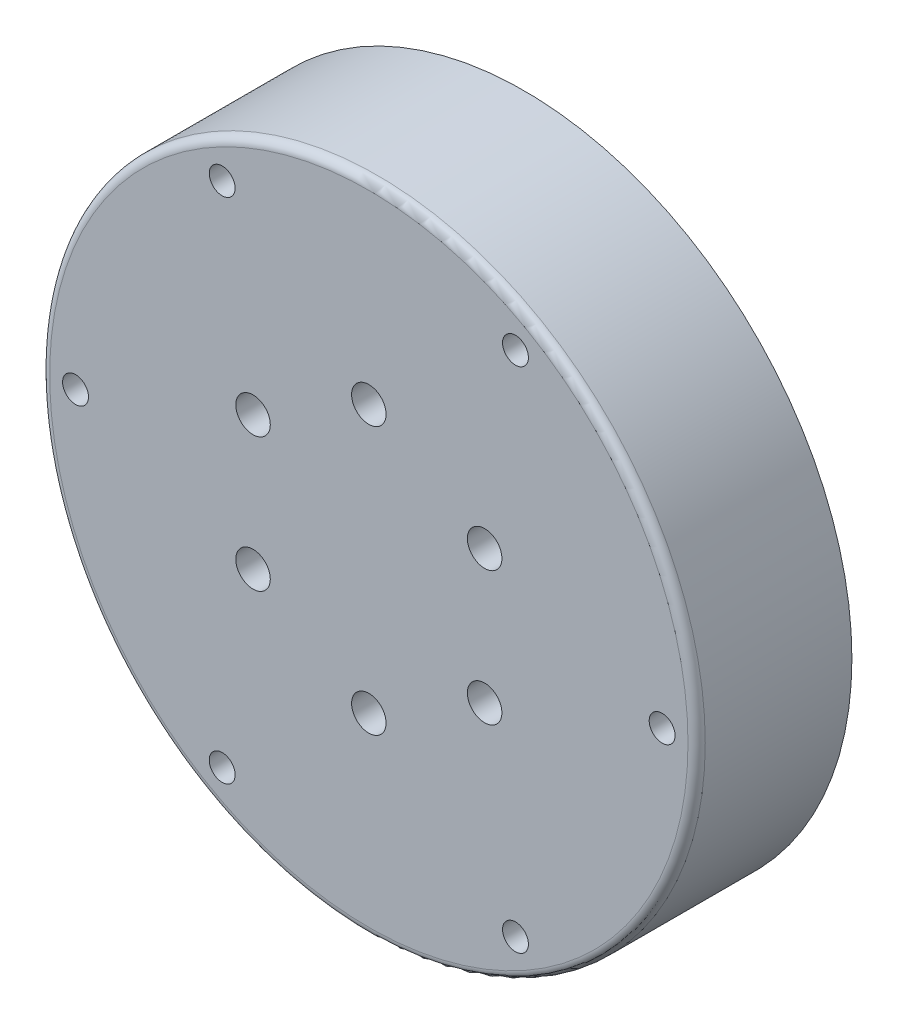
ISO-10303-21;
HEADER;
FILE_DESCRIPTION(('STEP AP214'),'2;1');
FILE_NAME('part.step','',(''),(''),'','','');
FILE_SCHEMA(('AUTOMOTIVE_DESIGN { 1 0 10303 214 1 1 1 1 }'));
ENDSEC;
DATA;
#1=APPLICATION_CONTEXT('core data for automotive mechanical design processes');
#2=APPLICATION_PROTOCOL_DEFINITION('international standard','automotive_design',2000,#1);
#3=PRODUCT_CONTEXT('',#1,'mechanical');
#4=PRODUCT('Part','Part','',(#3));
#5=PRODUCT_RELATED_PRODUCT_CATEGORY('part','',(#4));
#6=PRODUCT_DEFINITION_FORMATION('','',#4);
#7=PRODUCT_DEFINITION_CONTEXT('part definition',#1,'design');
#8=PRODUCT_DEFINITION('design','',#6,#7);
#9=PRODUCT_DEFINITION_SHAPE('','',#8);
#10=(LENGTH_UNIT() NAMED_UNIT(*) SI_UNIT(.MILLI.,.METRE.));
#11=(NAMED_UNIT(*) PLANE_ANGLE_UNIT() SI_UNIT($,.RADIAN.));
#12=(NAMED_UNIT(*) SI_UNIT($,.STERADIAN.) SOLID_ANGLE_UNIT());
#13=UNCERTAINTY_MEASURE_WITH_UNIT(LENGTH_MEASURE(1.E-05),#10,'distance_accuracy_value','');
#14=(GEOMETRIC_REPRESENTATION_CONTEXT(3) GLOBAL_UNCERTAINTY_ASSIGNED_CONTEXT((#13)) GLOBAL_UNIT_ASSIGNED_CONTEXT((#10,
#11,#12)) REPRESENTATION_CONTEXT('',''));
#15=CARTESIAN_POINT('',(0.,0.,0.));
#16=DIRECTION('',(0.,0.,1.));
#17=DIRECTION('',(1.,0.,0.));
#18=AXIS2_PLACEMENT_3D('',#15,#16,#17);
#19=CARTESIAN_POINT('',(0.,0.,18.));
#20=DIRECTION('',(0.,0.,-1.));
#21=DIRECTION('',(-1.,0.,0.));
#22=AXIS2_PLACEMENT_3D('',#19,#20,#21);
#23=CYLINDRICAL_SURFACE('',#22,38.);
#24=CARTESIAN_POINT('',(0.,0.,12.5));
#25=DIRECTION('',(0.,0.,1.));
#26=DIRECTION('',(1.,0.,0.));
#27=AXIS2_PLACEMENT_3D('',#24,#25,#26);
#28=CIRCLE('',#27,38.);
#29=CARTESIAN_POINT('',(10.,-36.6606055596467,12.5));
#30=VERTEX_POINT('',#29);
#31=CARTESIAN_POINT('',(-10.,-36.6606055596467,12.5));
#32=VERTEX_POINT('',#31);
#33=EDGE_CURVE('E117',#30,#32,#28,.F.);
#34=ORIENTED_EDGE('',*,*,#33,.F.);
#35=DIRECTION('',(0.,0.,-1.));
#36=VECTOR('',#35,1.);
#37=CARTESIAN_POINT('',(10.,-36.6606055596467,18.));
#38=LINE('',#37,#36);
#39=CARTESIAN_POINT('',(10.,-36.6606055596467,8.5));
#40=VERTEX_POINT('',#39);
#41=EDGE_CURVE('E97',#40,#30,#38,.F.);
#42=ORIENTED_EDGE('',*,*,#41,.F.);
#43=CARTESIAN_POINT('',(0.,0.,8.49999999999999));
#44=DIRECTION('',(0.,0.,-1.));
#45=DIRECTION('',(-1.,0.,0.));
#46=AXIS2_PLACEMENT_3D('',#43,#44,#45);
#47=CIRCLE('',#46,38.);
#48=CARTESIAN_POINT('',(-10.,-36.6606055596467,8.49999999999999));
#49=VERTEX_POINT('',#48);
#50=EDGE_CURVE('E108',#49,#40,#47,.F.);
#51=ORIENTED_EDGE('',*,*,#50,.F.);
#52=DIRECTION('',(0.,0.,-1.));
#53=VECTOR('',#52,1.);
#54=CARTESIAN_POINT('',(-10.,-36.6606055596467,18.));
#55=LINE('',#54,#53);
#56=EDGE_CURVE('E56',#32,#49,#55,.T.);
#57=ORIENTED_EDGE('',*,*,#56,.F.);
#58=EDGE_LOOP('',(#34,#42,#51,#57));
#59=FACE_BOUND('',#58,.T.);
#60=CARTESIAN_POINT('',(0.,0.,17.));
#61=DIRECTION('',(0.,0.,1.));
#62=DIRECTION('',(1.,0.,0.));
#63=AXIS2_PLACEMENT_3D('',#60,#61,#62);
#64=CIRCLE('',#63,38.);
#65=CARTESIAN_POINT('',(38.,0.,17.));
#66=VERTEX_POINT('',#65);
#67=EDGE_CURVE('E11',#66,#66,#64,.F.);
#68=ORIENTED_EDGE('',*,*,#67,.T.);
#69=EDGE_LOOP('',(#68));
#70=FACE_BOUND('',#69,.T.);
#71=CARTESIAN_POINT('',(0.,0.,0.));
#72=DIRECTION('',(0.,0.,1.));
#73=DIRECTION('',(1.,0.,0.));
#74=AXIS2_PLACEMENT_3D('',#71,#72,#73);
#75=CIRCLE('',#74,38.);
#76=CARTESIAN_POINT('',(38.,0.,0.));
#77=VERTEX_POINT('',#76);
#78=EDGE_CURVE('E170',#77,#77,#75,.T.);
#79=ORIENTED_EDGE('',*,*,#78,.T.);
#80=EDGE_LOOP('',(#79));
#81=FACE_BOUND('',#80,.T.);
#82=ADVANCED_FACE('F40',(#59,#70,#81),#23,.T.);
#83=CARTESIAN_POINT('',(0.,0.,18.));
#84=DIRECTION('',(0.,0.,1.));
#85=DIRECTION('',(1.,0.,0.));
#86=AXIS2_PLACEMENT_3D('',#83,#84,#85);
#87=PLANE('',#86);
#88=CARTESIAN_POINT('',(0.,15.5,18.));
#89=DIRECTION('',(0.,0.,1.));
#90=DIRECTION('',(1.,0.,0.));
#91=AXIS2_PLACEMENT_3D('',#88,#89,#90);
#92=CIRCLE('',#91,2.);
#93=CARTESIAN_POINT('',(2.,15.5,18.));
#94=VERTEX_POINT('',#93);
#95=EDGE_CURVE('E310',#94,#94,#92,.T.);
#96=ORIENTED_EDGE('',*,*,#95,.F.);
#97=EDGE_LOOP('',(#96));
#98=FACE_BOUND('',#97,.T.);
#99=CARTESIAN_POINT('',(-13.4233937586588,7.74999999999999,18.));
#100=DIRECTION('',(0.,0.,1.));
#101=DIRECTION('',(1.,0.,0.));
#102=AXIS2_PLACEMENT_3D('',#99,#100,#101);
#103=CIRCLE('',#102,2.);
#104=CARTESIAN_POINT('',(-11.4233937586588,7.74999999999999,18.));
#105=VERTEX_POINT('',#104);
#106=EDGE_CURVE('E318',#105,#105,#103,.T.);
#107=ORIENTED_EDGE('',*,*,#106,.F.);
#108=EDGE_LOOP('',(#107));
#109=FACE_BOUND('',#108,.T.);
#110=CARTESIAN_POINT('',(-13.4233937586588,-7.75000000000001,18.));
#111=DIRECTION('',(0.,0.,1.));
#112=DIRECTION('',(1.,0.,0.));
#113=AXIS2_PLACEMENT_3D('',#110,#111,#112);
#114=CIRCLE('',#113,2.);
#115=CARTESIAN_POINT('',(-11.4233937586588,-7.75000000000001,18.));
#116=VERTEX_POINT('',#115);
#117=EDGE_CURVE('E350',#116,#116,#114,.T.);
#118=ORIENTED_EDGE('',*,*,#117,.F.);
#119=EDGE_LOOP('',(#118));
#120=FACE_BOUND('',#119,.T.);
#121=CARTESIAN_POINT('',(0.,-15.5,18.));
#122=DIRECTION('',(0.,0.,1.));
#123=DIRECTION('',(1.,0.,0.));
#124=AXIS2_PLACEMENT_3D('',#121,#122,#123);
#125=CIRCLE('',#124,2.);
#126=CARTESIAN_POINT('',(2.00000000000001,-15.5,18.));
#127=VERTEX_POINT('',#126);
#128=EDGE_CURVE('E342',#127,#127,#125,.T.);
#129=ORIENTED_EDGE('',*,*,#128,.F.);
#130=EDGE_LOOP('',(#129));
#131=FACE_BOUND('',#130,.T.);
#132=CARTESIAN_POINT('',(13.4233937586588,-7.75,18.));
#133=DIRECTION('',(0.,0.,1.));
#134=DIRECTION('',(1.,0.,0.));
#135=AXIS2_PLACEMENT_3D('',#132,#133,#134);
#136=CIRCLE('',#135,2.);
#137=CARTESIAN_POINT('',(15.4233937586588,-7.75,18.));
#138=VERTEX_POINT('',#137);
#139=EDGE_CURVE('E334',#138,#138,#136,.T.);
#140=ORIENTED_EDGE('',*,*,#139,.F.);
#141=EDGE_LOOP('',(#140));
#142=FACE_BOUND('',#141,.T.);
#143=CARTESIAN_POINT('',(13.4233937586588,7.75000000000001,18.));
#144=DIRECTION('',(0.,0.,1.));
#145=DIRECTION('',(1.,0.,0.));
#146=AXIS2_PLACEMENT_3D('',#143,#144,#145);
#147=CIRCLE('',#146,2.);
#148=CARTESIAN_POINT('',(15.4233937586588,7.75000000000001,18.));
#149=VERTEX_POINT('',#148);
#150=EDGE_CURVE('E315',#149,#149,#147,.T.);
#151=ORIENTED_EDGE('',*,*,#150,.F.);
#152=EDGE_LOOP('',(#151));
#153=FACE_BOUND('',#152,.T.);
#154=CARTESIAN_POINT('',(0.,0.,18.));
#155=DIRECTION('',(0.,0.,1.));
#156=DIRECTION('',(1.,0.,0.));
#157=AXIS2_PLACEMENT_3D('',#154,#155,#156);
#158=CIRCLE('',#157,37.);
#159=CARTESIAN_POINT('',(37.,0.,18.));
#160=VERTEX_POINT('',#159);
#161=EDGE_CURVE('E49',#160,#160,#158,.T.);
#162=ORIENTED_EDGE('',*,*,#161,.T.);
#163=EDGE_LOOP('',(#162));
#164=FACE_BOUND('',#163,.T.);
#165=CARTESIAN_POINT('',(34.,-2.37420731041333E-13,18.));
#166=DIRECTION('',(0.,0.,1.));
#167=DIRECTION('',(1.,0.,0.));
#168=AXIS2_PLACEMENT_3D('',#165,#166,#167);
#169=CIRCLE('',#168,1.5);
#170=CARTESIAN_POINT('',(35.5,-2.37420731041333E-13,18.));
#171=VERTEX_POINT('',#170);
#172=EDGE_CURVE('E161',#171,#171,#169,.T.);
#173=ORIENTED_EDGE('',*,*,#172,.F.);
#174=EDGE_LOOP('',(#173));
#175=FACE_BOUND('',#174,.T.);
#176=CARTESIAN_POINT('',(16.9999999999997,-29.4448637286711,18.));
#177=DIRECTION('',(0.,0.,1.));
#178=DIRECTION('',(1.,0.,0.));
#179=AXIS2_PLACEMENT_3D('',#176,#177,#178);
#180=CIRCLE('',#179,1.5);
#181=CARTESIAN_POINT('',(18.4999999999997,-29.4448637286711,18.));
#182=VERTEX_POINT('',#181);
#183=EDGE_CURVE('E174',#182,#182,#180,.T.);
#184=ORIENTED_EDGE('',*,*,#183,.F.);
#185=EDGE_LOOP('',(#184));
#186=FACE_BOUND('',#185,.T.);
#187=CARTESIAN_POINT('',(-17.0000000000004,-29.4448637286707,18.));
#188=DIRECTION('',(0.,0.,1.));
#189=DIRECTION('',(1.,0.,0.));
#190=AXIS2_PLACEMENT_3D('',#187,#188,#189);
#191=CIRCLE('',#190,1.49999999999998);
#192=CARTESIAN_POINT('',(-15.5000000000004,-29.4448637286707,18.));
#193=VERTEX_POINT('',#192);
#194=EDGE_CURVE('E199',#193,#193,#191,.T.);
#195=ORIENTED_EDGE('',*,*,#194,.F.);
#196=EDGE_LOOP('',(#195));
#197=FACE_BOUND('',#196,.T.);
#198=CARTESIAN_POINT('',(-34.,0.,18.));
#199=DIRECTION('',(0.,0.,1.));
#200=DIRECTION('',(1.,0.,0.));
#201=AXIS2_PLACEMENT_3D('',#198,#199,#200);
#202=CIRCLE('',#201,1.5);
#203=CARTESIAN_POINT('',(-32.5,0.,18.));
#204=VERTEX_POINT('',#203);
#205=EDGE_CURVE('E191',#204,#204,#202,.T.);
#206=ORIENTED_EDGE('',*,*,#205,.F.);
#207=EDGE_LOOP('',(#206));
#208=FACE_BOUND('',#207,.T.);
#209=CARTESIAN_POINT('',(-16.9999999999999,29.444863728671,18.));
#210=DIRECTION('',(0.,0.,1.));
#211=DIRECTION('',(1.,0.,0.));
#212=AXIS2_PLACEMENT_3D('',#209,#210,#211);
#213=CIRCLE('',#212,1.5);
#214=CARTESIAN_POINT('',(-15.4999999999999,29.444863728671,18.));
#215=VERTEX_POINT('',#214);
#216=EDGE_CURVE('E183',#215,#215,#213,.T.);
#217=ORIENTED_EDGE('',*,*,#216,.F.);
#218=EDGE_LOOP('',(#217));
#219=FACE_BOUND('',#218,.T.);
#220=CARTESIAN_POINT('',(17.0000000000001,29.4448637286708,18.));
#221=DIRECTION('',(0.,0.,1.));
#222=DIRECTION('',(1.,0.,0.));
#223=AXIS2_PLACEMENT_3D('',#220,#221,#222);
#224=CIRCLE('',#223,1.5);
#225=CARTESIAN_POINT('',(18.5000000000001,29.4448637286708,18.));
#226=VERTEX_POINT('',#225);
#227=EDGE_CURVE('E166',#226,#226,#224,.T.);
#228=ORIENTED_EDGE('',*,*,#227,.F.);
#229=EDGE_LOOP('',(#228));
#230=FACE_BOUND('',#229,.T.);
#231=ADVANCED_FACE('F215',(#98,#109,#120,#131,#142,#153,#164,#175,#186,#197,#208,#219,#230),#87,.T.);
#232=CARTESIAN_POINT('',(0.,0.,0.));
#233=DIRECTION('',(0.,0.,1.));
#234=DIRECTION('',(1.,0.,0.));
#235=AXIS2_PLACEMENT_3D('',#232,#233,#234);
#236=PLANE('',#235);
#237=DIRECTION('',(-1.,0.,0.));
#238=VECTOR('',#237,1.);
#239=CARTESIAN_POINT('',(13.076696830622,-27.,0.));
#240=LINE('',#239,#238);
#241=CARTESIAN_POINT('',(13.076696830622,-27.,0.));
#242=VERTEX_POINT('',#241);
#243=CARTESIAN_POINT('',(-13.076696830622,-27.,0.));
#244=VERTEX_POINT('',#243);
#245=EDGE_CURVE('E143',#242,#244,#240,.T.);
#246=ORIENTED_EDGE('',*,*,#245,.F.);
#247=CARTESIAN_POINT('',(0.,0.,0.));
#248=DIRECTION('',(0.,0.,-1.));
#249=DIRECTION('',(-1.,0.,0.));
#250=AXIS2_PLACEMENT_3D('',#247,#248,#249);
#251=CIRCLE('',#250,30.);
#252=EDGE_CURVE('E112',#244,#242,#251,.T.);
#253=ORIENTED_EDGE('',*,*,#252,.F.);
#254=EDGE_LOOP('',(#246,#253));
#255=FACE_BOUND('',#254,.T.);
#256=CARTESIAN_POINT('',(34.,-2.37420731041333E-13,0.));
#257=DIRECTION('',(0.,0.,1.));
#258=DIRECTION('',(1.,0.,0.));
#259=AXIS2_PLACEMENT_3D('',#256,#257,#258);
#260=CIRCLE('',#259,1.5);
#261=CARTESIAN_POINT('',(35.5,-2.37420731041333E-13,0.));
#262=VERTEX_POINT('',#261);
#263=EDGE_CURVE('E165',#262,#262,#260,.F.);
#264=ORIENTED_EDGE('',*,*,#263,.F.);
#265=EDGE_LOOP('',(#264));
#266=FACE_BOUND('',#265,.T.);
#267=CARTESIAN_POINT('',(16.9999999999997,-29.4448637286711,0.));
#268=DIRECTION('',(0.,0.,1.));
#269=DIRECTION('',(1.,0.,0.));
#270=AXIS2_PLACEMENT_3D('',#267,#268,#269);
#271=CIRCLE('',#270,1.5);
#272=CARTESIAN_POINT('',(18.4999999999997,-29.4448637286711,0.));
#273=VERTEX_POINT('',#272);
#274=EDGE_CURVE('E157',#273,#273,#271,.F.);
#275=ORIENTED_EDGE('',*,*,#274,.F.);
#276=EDGE_LOOP('',(#275));
#277=FACE_BOUND('',#276,.T.);
#278=CARTESIAN_POINT('',(-17.0000000000004,-29.4448637286707,0.));
#279=DIRECTION('',(0.,0.,1.));
#280=DIRECTION('',(1.,0.,0.));
#281=AXIS2_PLACEMENT_3D('',#278,#279,#280);
#282=CIRCLE('',#281,1.49999999999998);
#283=CARTESIAN_POINT('',(-15.5000000000004,-29.4448637286707,0.));
#284=VERTEX_POINT('',#283);
#285=EDGE_CURVE('E178',#284,#284,#282,.F.);
#286=ORIENTED_EDGE('',*,*,#285,.F.);
#287=EDGE_LOOP('',(#286));
#288=FACE_BOUND('',#287,.T.);
#289=CARTESIAN_POINT('',(-34.,0.,0.));
#290=DIRECTION('',(0.,0.,1.));
#291=DIRECTION('',(1.,0.,0.));
#292=AXIS2_PLACEMENT_3D('',#289,#290,#291);
#293=CIRCLE('',#292,1.5);
#294=CARTESIAN_POINT('',(-32.5,0.,0.));
#295=VERTEX_POINT('',#294);
#296=EDGE_CURVE('E195',#295,#295,#293,.F.);
#297=ORIENTED_EDGE('',*,*,#296,.F.);
#298=EDGE_LOOP('',(#297));
#299=FACE_BOUND('',#298,.T.);
#300=CARTESIAN_POINT('',(-16.9999999999999,29.444863728671,0.));
#301=DIRECTION('',(0.,0.,1.));
#302=DIRECTION('',(1.,0.,0.));
#303=AXIS2_PLACEMENT_3D('',#300,#301,#302);
#304=CIRCLE('',#303,1.5);
#305=CARTESIAN_POINT('',(-15.4999999999999,29.444863728671,0.));
#306=VERTEX_POINT('',#305);
#307=EDGE_CURVE('E187',#306,#306,#304,.F.);
#308=ORIENTED_EDGE('',*,*,#307,.F.);
#309=EDGE_LOOP('',(#308));
#310=FACE_BOUND('',#309,.T.);
#311=CARTESIAN_POINT('',(17.0000000000001,29.4448637286708,0.));
#312=DIRECTION('',(0.,0.,1.));
#313=DIRECTION('',(1.,0.,0.));
#314=AXIS2_PLACEMENT_3D('',#311,#312,#313);
#315=CIRCLE('',#314,1.5);
#316=CARTESIAN_POINT('',(18.5000000000001,29.4448637286708,0.));
#317=VERTEX_POINT('',#316);
#318=EDGE_CURVE('E179',#317,#317,#315,.F.);
#319=ORIENTED_EDGE('',*,*,#318,.F.);
#320=EDGE_LOOP('',(#319));
#321=FACE_BOUND('',#320,.T.);
#322=ORIENTED_EDGE('',*,*,#78,.F.);
#323=EDGE_LOOP('',(#322));
#324=FACE_BOUND('',#323,.T.);
#325=ADVANCED_FACE('F237',(#255,#266,#277,#288,#299,#310,#321,#324),#236,.F.);
#326=CARTESIAN_POINT('',(17.0000000000001,29.4448637286708,-0.001000000000001));
#327=DIRECTION('',(0.,0.,1.));
#328=DIRECTION('',(1.,0.,0.));
#329=AXIS2_PLACEMENT_3D('',#326,#327,#328);
#330=CYLINDRICAL_SURFACE('',#329,1.5);
#331=ORIENTED_EDGE('',*,*,#227,.T.);
#332=EDGE_LOOP('',(#331));
#333=FACE_BOUND('',#332,.T.);
#334=ORIENTED_EDGE('',*,*,#318,.T.);
#335=EDGE_LOOP('',(#334));
#336=FACE_BOUND('',#335,.T.);
#337=ADVANCED_FACE('F242',(#333,#336),#330,.F.);
#338=CARTESIAN_POINT('',(-16.9999999999999,29.444863728671,-0.001000000000001));
#339=DIRECTION('',(0.,0.,1.));
#340=DIRECTION('',(1.,0.,0.));
#341=AXIS2_PLACEMENT_3D('',#338,#339,#340);
#342=CYLINDRICAL_SURFACE('',#341,1.5);
#343=ORIENTED_EDGE('',*,*,#216,.T.);
#344=EDGE_LOOP('',(#343));
#345=FACE_BOUND('',#344,.T.);
#346=ORIENTED_EDGE('',*,*,#307,.T.);
#347=EDGE_LOOP('',(#346));
#348=FACE_BOUND('',#347,.T.);
#349=ADVANCED_FACE('F253',(#345,#348),#342,.F.);
#350=CARTESIAN_POINT('',(-34.,0.,-0.001000000000001));
#351=DIRECTION('',(0.,0.,1.));
#352=DIRECTION('',(1.,0.,0.));
#353=AXIS2_PLACEMENT_3D('',#350,#351,#352);
#354=CYLINDRICAL_SURFACE('',#353,1.5);
#355=ORIENTED_EDGE('',*,*,#205,.T.);
#356=EDGE_LOOP('',(#355));
#357=FACE_BOUND('',#356,.T.);
#358=ORIENTED_EDGE('',*,*,#296,.T.);
#359=EDGE_LOOP('',(#358));
#360=FACE_BOUND('',#359,.T.);
#361=ADVANCED_FACE('F249',(#357,#360),#354,.F.);
#362=CARTESIAN_POINT('',(-17.0000000000004,-29.4448637286707,-0.001000000000001));
#363=DIRECTION('',(0.,0.,1.));
#364=DIRECTION('',(1.,0.,0.));
#365=AXIS2_PLACEMENT_3D('',#362,#363,#364);
#366=CYLINDRICAL_SURFACE('',#365,1.49999999999998);
#367=ORIENTED_EDGE('',*,*,#194,.T.);
#368=EDGE_LOOP('',(#367));
#369=FACE_BOUND('',#368,.T.);
#370=ORIENTED_EDGE('',*,*,#285,.T.);
#371=EDGE_LOOP('',(#370));
#372=FACE_BOUND('',#371,.T.);
#373=ADVANCED_FACE('F245',(#369,#372),#366,.F.);
#374=CARTESIAN_POINT('',(16.9999999999997,-29.4448637286711,-0.001000000000001));
#375=DIRECTION('',(0.,0.,1.));
#376=DIRECTION('',(1.,0.,0.));
#377=AXIS2_PLACEMENT_3D('',#374,#375,#376);
#378=CYLINDRICAL_SURFACE('',#377,1.5);
#379=ORIENTED_EDGE('',*,*,#183,.T.);
#380=EDGE_LOOP('',(#379));
#381=FACE_BOUND('',#380,.T.);
#382=ORIENTED_EDGE('',*,*,#274,.T.);
#383=EDGE_LOOP('',(#382));
#384=FACE_BOUND('',#383,.T.);
#385=ADVANCED_FACE('F248',(#381,#384),#378,.F.);
#386=CARTESIAN_POINT('',(34.,-2.37420731041333E-13,-0.001000000000001));
#387=DIRECTION('',(0.,0.,1.));
#388=DIRECTION('',(1.,0.,0.));
#389=AXIS2_PLACEMENT_3D('',#386,#387,#388);
#390=CYLINDRICAL_SURFACE('',#389,1.5);
#391=ORIENTED_EDGE('',*,*,#172,.T.);
#392=EDGE_LOOP('',(#391));
#393=FACE_BOUND('',#392,.T.);
#394=ORIENTED_EDGE('',*,*,#263,.T.);
#395=EDGE_LOOP('',(#394));
#396=FACE_BOUND('',#395,.T.);
#397=ADVANCED_FACE('F263',(#393,#396),#390,.F.);
#398=CARTESIAN_POINT('',(0.,0.,12.5));
#399=DIRECTION('',(0.,0.,-1.));
#400=DIRECTION('',(-1.,0.,0.));
#401=AXIS2_PLACEMENT_3D('',#398,#399,#400);
#402=CYLINDRICAL_SURFACE('',#401,30.);
#403=ORIENTED_EDGE('',*,*,#252,.T.);
#404=DIRECTION('',(0.,0.,-1.));
#405=VECTOR('',#404,1.);
#406=CARTESIAN_POINT('',(13.076696830622,-27.,12.5));
#407=LINE('',#406,#405);
#408=CARTESIAN_POINT('',(13.076696830622,-27.,12.5));
#409=VERTEX_POINT('',#408);
#410=EDGE_CURVE('E148',#409,#242,#407,.T.);
#411=ORIENTED_EDGE('',*,*,#410,.F.);
#412=CARTESIAN_POINT('',(0.,0.,12.5));
#413=DIRECTION('',(0.,0.,-1.));
#414=DIRECTION('',(-1.,0.,0.));
#415=AXIS2_PLACEMENT_3D('',#412,#413,#414);
#416=CIRCLE('',#415,30.);
#417=CARTESIAN_POINT('',(-13.076696830622,-27.,12.5));
#418=VERTEX_POINT('',#417);
#419=EDGE_CURVE('E138',#418,#409,#416,.T.);
#420=ORIENTED_EDGE('',*,*,#419,.F.);
#421=DIRECTION('',(0.,0.,-1.));
#422=VECTOR('',#421,1.);
#423=CARTESIAN_POINT('',(-13.076696830622,-27.,12.5));
#424=LINE('',#423,#422);
#425=EDGE_CURVE('E154',#418,#244,#424,.T.);
#426=ORIENTED_EDGE('',*,*,#425,.T.);
#427=EDGE_LOOP('',(#403,#411,#420,#426));
#428=FACE_BOUND('',#427,.T.);
#429=ADVANCED_FACE('F267',(#428),#402,.F.);
#430=CARTESIAN_POINT('',(13.076696830622,-27.,12.5));
#431=DIRECTION('',(0.,-1.,0.));
#432=DIRECTION('',(0.,0.,-1.));
#433=AXIS2_PLACEMENT_3D('',#430,#431,#432);
#434=PLANE('',#433);
#435=DIRECTION('',(-1.,0.,0.));
#436=VECTOR('',#435,1.);
#437=CARTESIAN_POINT('',(-10.,-27.,8.49999999999999));
#438=LINE('',#437,#436);
#439=CARTESIAN_POINT('',(10.,-27.,8.5));
#440=VERTEX_POINT('',#439);
#441=CARTESIAN_POINT('',(-10.,-27.,8.49999999999999));
#442=VERTEX_POINT('',#441);
#443=EDGE_CURVE('E122',#440,#442,#438,.T.);
#444=ORIENTED_EDGE('',*,*,#443,.F.);
#445=DIRECTION('',(0.,0.,-1.));
#446=VECTOR('',#445,1.);
#447=CARTESIAN_POINT('',(10.,-27.,8.5));
#448=LINE('',#447,#446);
#449=CARTESIAN_POINT('',(10.,-27.,12.5));
#450=VERTEX_POINT('',#449);
#451=EDGE_CURVE('E100',#450,#440,#448,.T.);
#452=ORIENTED_EDGE('',*,*,#451,.F.);
#453=DIRECTION('',(-1.,0.,0.));
#454=VECTOR('',#453,1.);
#455=CARTESIAN_POINT('',(13.076696830622,-27.,12.5));
#456=LINE('',#455,#454);
#457=EDGE_CURVE('E144',#409,#450,#456,.T.);
#458=ORIENTED_EDGE('',*,*,#457,.F.);
#459=ORIENTED_EDGE('',*,*,#410,.T.);
#460=ORIENTED_EDGE('',*,*,#245,.T.);
#461=ORIENTED_EDGE('',*,*,#425,.F.);
#462=CARTESIAN_POINT('',(-10.,-27.,12.5));
#463=VERTEX_POINT('',#462);
#464=EDGE_CURVE('E142',#463,#418,#456,.T.);
#465=ORIENTED_EDGE('',*,*,#464,.F.);
#466=DIRECTION('',(0.,0.,1.));
#467=VECTOR('',#466,1.);
#468=CARTESIAN_POINT('',(-10.,-27.,8.49999999999999));
#469=LINE('',#468,#467);
#470=EDGE_CURVE('E61',#442,#463,#469,.T.);
#471=ORIENTED_EDGE('',*,*,#470,.F.);
#472=EDGE_LOOP('',(#444,#452,#458,#459,#460,#461,#465,#471));
#473=FACE_BOUND('',#472,.T.);
#474=ADVANCED_FACE('F228',(#473),#434,.F.);
#475=CARTESIAN_POINT('',(0.,0.,12.5));
#476=DIRECTION('',(0.,0.,-1.));
#477=DIRECTION('',(-1.,0.,0.));
#478=AXIS2_PLACEMENT_3D('',#475,#476,#477);
#479=PLANE('',#478);
#480=CARTESIAN_POINT('',(0.,15.5,12.5));
#481=DIRECTION('',(0.,0.,-1.));
#482=DIRECTION('',(-1.,0.,0.));
#483=AXIS2_PLACEMENT_3D('',#480,#481,#482);
#484=CIRCLE('',#483,2.);
#485=CARTESIAN_POINT('',(-2.,15.5,12.5));
#486=VERTEX_POINT('',#485);
#487=EDGE_CURVE('E307',#486,#486,#484,.F.);
#488=ORIENTED_EDGE('',*,*,#487,.T.);
#489=EDGE_LOOP('',(#488));
#490=FACE_BOUND('',#489,.T.);
#491=CARTESIAN_POINT('',(-13.4233937586588,7.74999999999999,12.5));
#492=DIRECTION('',(0.,0.,-1.));
#493=DIRECTION('',(-1.,0.,0.));
#494=AXIS2_PLACEMENT_3D('',#491,#492,#493);
#495=CIRCLE('',#494,2.);
#496=CARTESIAN_POINT('',(-15.4233937586588,7.74999999999999,12.5));
#497=VERTEX_POINT('',#496);
#498=EDGE_CURVE('E323',#497,#497,#495,.F.);
#499=ORIENTED_EDGE('',*,*,#498,.T.);
#500=EDGE_LOOP('',(#499));
#501=FACE_BOUND('',#500,.T.);
#502=CARTESIAN_POINT('',(-13.4233937586588,-7.75000000000001,12.5));
#503=DIRECTION('',(0.,0.,-1.));
#504=DIRECTION('',(-1.,0.,0.));
#505=AXIS2_PLACEMENT_3D('',#502,#503,#504);
#506=CIRCLE('',#505,2.);
#507=CARTESIAN_POINT('',(-15.4233937586588,-7.75000000000001,12.5));
#508=VERTEX_POINT('',#507);
#509=EDGE_CURVE('E322',#508,#508,#506,.F.);
#510=ORIENTED_EDGE('',*,*,#509,.T.);
#511=EDGE_LOOP('',(#510));
#512=FACE_BOUND('',#511,.T.);
#513=CARTESIAN_POINT('',(0.,-15.5,12.5));
#514=DIRECTION('',(0.,0.,-1.));
#515=DIRECTION('',(-1.,0.,0.));
#516=AXIS2_PLACEMENT_3D('',#513,#514,#515);
#517=CIRCLE('',#516,2.);
#518=CARTESIAN_POINT('',(-2.,-15.5,12.5));
#519=VERTEX_POINT('',#518);
#520=EDGE_CURVE('E346',#519,#519,#517,.F.);
#521=ORIENTED_EDGE('',*,*,#520,.T.);
#522=EDGE_LOOP('',(#521));
#523=FACE_BOUND('',#522,.T.);
#524=CARTESIAN_POINT('',(13.4233937586588,-7.75,12.5));
#525=DIRECTION('',(0.,0.,-1.));
#526=DIRECTION('',(-1.,0.,0.));
#527=AXIS2_PLACEMENT_3D('',#524,#525,#526);
#528=CIRCLE('',#527,2.);
#529=CARTESIAN_POINT('',(11.4233937586588,-7.75,12.5));
#530=VERTEX_POINT('',#529);
#531=EDGE_CURVE('E338',#530,#530,#528,.F.);
#532=ORIENTED_EDGE('',*,*,#531,.T.);
#533=EDGE_LOOP('',(#532));
#534=FACE_BOUND('',#533,.T.);
#535=CARTESIAN_POINT('',(13.4233937586588,7.75000000000001,12.5));
#536=DIRECTION('',(0.,0.,-1.));
#537=DIRECTION('',(-1.,0.,0.));
#538=AXIS2_PLACEMENT_3D('',#535,#536,#537);
#539=CIRCLE('',#538,2.);
#540=CARTESIAN_POINT('',(11.4233937586588,7.75000000000001,12.5));
#541=VERTEX_POINT('',#540);
#542=EDGE_CURVE('E330',#541,#541,#539,.F.);
#543=ORIENTED_EDGE('',*,*,#542,.T.);
#544=EDGE_LOOP('',(#543));
#545=FACE_BOUND('',#544,.T.);
#546=ORIENTED_EDGE('',*,*,#419,.T.);
#547=ORIENTED_EDGE('',*,*,#457,.T.);
#548=DIRECTION('',(0.,1.,0.));
#549=VECTOR('',#548,1.);
#550=CARTESIAN_POINT('',(10.,-38.001,12.5));
#551=LINE('',#550,#549);
#552=EDGE_CURVE('E113',#30,#450,#551,.T.);
#553=ORIENTED_EDGE('',*,*,#552,.F.);
#554=ORIENTED_EDGE('',*,*,#33,.T.);
#555=DIRECTION('',(0.,1.,0.));
#556=VECTOR('',#555,1.);
#557=CARTESIAN_POINT('',(-10.,-38.001,12.5));
#558=LINE('',#557,#556);
#559=EDGE_CURVE('E133',#32,#463,#558,.T.);
#560=ORIENTED_EDGE('',*,*,#559,.T.);
#561=ORIENTED_EDGE('',*,*,#464,.T.);
#562=EDGE_LOOP('',(#546,#547,#553,#554,#560,#561));
#563=FACE_BOUND('',#562,.T.);
#564=ADVANCED_FACE('F219',(#490,#501,#512,#523,#534,#545,#563),#479,.T.);
#565=CARTESIAN_POINT('',(0.,0.,17.));
#566=DIRECTION('',(0.,0.,1.));
#567=DIRECTION('',(1.,0.,0.));
#568=AXIS2_PLACEMENT_3D('',#565,#566,#567);
#569=TOROIDAL_SURFACE('',#568,37.,1.);
#570=ORIENTED_EDGE('',*,*,#67,.F.);
#571=EDGE_LOOP('',(#570));
#572=FACE_BOUND('',#571,.T.);
#573=ORIENTED_EDGE('',*,*,#161,.F.);
#574=EDGE_LOOP('',(#573));
#575=FACE_BOUND('',#574,.T.);
#576=ADVANCED_FACE('F42',(#572,#575),#569,.T.);
#577=CARTESIAN_POINT('',(10.,-38.001,8.5));
#578=DIRECTION('',(1.,0.,0.));
#579=DIRECTION('',(0.,0.,-1.));
#580=AXIS2_PLACEMENT_3D('',#577,#578,#579);
#581=PLANE('',#580);
#582=ORIENTED_EDGE('',*,*,#41,.T.);
#583=ORIENTED_EDGE('',*,*,#552,.T.);
#584=ORIENTED_EDGE('',*,*,#451,.T.);
#585=DIRECTION('',(0.,1.,0.));
#586=VECTOR('',#585,1.);
#587=CARTESIAN_POINT('',(10.,-38.001,8.5));
#588=LINE('',#587,#586);
#589=EDGE_CURVE('E93',#40,#440,#588,.T.);
#590=ORIENTED_EDGE('',*,*,#589,.F.);
#591=EDGE_LOOP('',(#582,#583,#584,#590));
#592=FACE_BOUND('',#591,.T.);
#593=ADVANCED_FACE('F95',(#592),#581,.F.);
#594=CARTESIAN_POINT('',(-10.,-38.001,8.49999999999999));
#595=DIRECTION('',(-1.,0.,0.));
#596=DIRECTION('',(0.,0.,1.));
#597=AXIS2_PLACEMENT_3D('',#594,#595,#596);
#598=PLANE('',#597);
#599=ORIENTED_EDGE('',*,*,#56,.T.);
#600=DIRECTION('',(0.,1.,0.));
#601=VECTOR('',#600,1.);
#602=CARTESIAN_POINT('',(-10.,-38.001,8.49999999999999));
#603=LINE('',#602,#601);
#604=EDGE_CURVE('E105',#49,#442,#603,.T.);
#605=ORIENTED_EDGE('',*,*,#604,.T.);
#606=ORIENTED_EDGE('',*,*,#470,.T.);
#607=ORIENTED_EDGE('',*,*,#559,.F.);
#608=EDGE_LOOP('',(#599,#605,#606,#607));
#609=FACE_BOUND('',#608,.T.);
#610=ADVANCED_FACE('F225',(#609),#598,.F.);
#611=CARTESIAN_POINT('',(-10.,-38.001,8.49999999999999));
#612=DIRECTION('',(0.,0.,-1.));
#613=DIRECTION('',(-1.,0.,0.));
#614=AXIS2_PLACEMENT_3D('',#611,#612,#613);
#615=PLANE('',#614);
#616=ORIENTED_EDGE('',*,*,#50,.T.);
#617=ORIENTED_EDGE('',*,*,#589,.T.);
#618=ORIENTED_EDGE('',*,*,#443,.T.);
#619=ORIENTED_EDGE('',*,*,#604,.F.);
#620=EDGE_LOOP('',(#616,#617,#618,#619));
#621=FACE_BOUND('',#620,.T.);
#622=ADVANCED_FACE('F109',(#621),#615,.F.);
#623=CARTESIAN_POINT('',(13.4233937586588,7.75000000000001,-0.001000000000001));
#624=DIRECTION('',(0.,0.,1.));
#625=DIRECTION('',(1.,0.,0.));
#626=AXIS2_PLACEMENT_3D('',#623,#624,#625);
#627=CYLINDRICAL_SURFACE('',#626,2.);
#628=ORIENTED_EDGE('',*,*,#542,.F.);
#629=EDGE_LOOP('',(#628));
#630=FACE_BOUND('',#629,.T.);
#631=ORIENTED_EDGE('',*,*,#150,.T.);
#632=EDGE_LOOP('',(#631));
#633=FACE_BOUND('',#632,.T.);
#634=ADVANCED_FACE('F277',(#630,#633),#627,.F.);
#635=CARTESIAN_POINT('',(13.4233937586588,-7.75,-0.001000000000001));
#636=DIRECTION('',(0.,0.,1.));
#637=DIRECTION('',(1.,0.,0.));
#638=AXIS2_PLACEMENT_3D('',#635,#636,#637);
#639=CYLINDRICAL_SURFACE('',#638,2.);
#640=ORIENTED_EDGE('',*,*,#531,.F.);
#641=EDGE_LOOP('',(#640));
#642=FACE_BOUND('',#641,.T.);
#643=ORIENTED_EDGE('',*,*,#139,.T.);
#644=EDGE_LOOP('',(#643));
#645=FACE_BOUND('',#644,.T.);
#646=ADVANCED_FACE('F288',(#642,#645),#639,.F.);
#647=CARTESIAN_POINT('',(0.,-15.5,-0.001000000000001));
#648=DIRECTION('',(0.,0.,1.));
#649=DIRECTION('',(1.,0.,0.));
#650=AXIS2_PLACEMENT_3D('',#647,#648,#649);
#651=CYLINDRICAL_SURFACE('',#650,2.);
#652=ORIENTED_EDGE('',*,*,#520,.F.);
#653=EDGE_LOOP('',(#652));
#654=FACE_BOUND('',#653,.T.);
#655=ORIENTED_EDGE('',*,*,#128,.T.);
#656=EDGE_LOOP('',(#655));
#657=FACE_BOUND('',#656,.T.);
#658=ADVANCED_FACE('F284',(#654,#657),#651,.F.);
#659=CARTESIAN_POINT('',(-13.4233937586588,-7.75000000000001,-0.001000000000001));
#660=DIRECTION('',(0.,0.,1.));
#661=DIRECTION('',(1.,0.,0.));
#662=AXIS2_PLACEMENT_3D('',#659,#660,#661);
#663=CYLINDRICAL_SURFACE('',#662,2.);
#664=ORIENTED_EDGE('',*,*,#509,.F.);
#665=EDGE_LOOP('',(#664));
#666=FACE_BOUND('',#665,.T.);
#667=ORIENTED_EDGE('',*,*,#117,.T.);
#668=EDGE_LOOP('',(#667));
#669=FACE_BOUND('',#668,.T.);
#670=ADVANCED_FACE('F280',(#666,#669),#663,.F.);
#671=CARTESIAN_POINT('',(-13.4233937586588,7.74999999999999,-0.001000000000001));
#672=DIRECTION('',(0.,0.,1.));
#673=DIRECTION('',(1.,0.,0.));
#674=AXIS2_PLACEMENT_3D('',#671,#672,#673);
#675=CYLINDRICAL_SURFACE('',#674,2.);
#676=ORIENTED_EDGE('',*,*,#498,.F.);
#677=EDGE_LOOP('',(#676));
#678=FACE_BOUND('',#677,.T.);
#679=ORIENTED_EDGE('',*,*,#106,.T.);
#680=EDGE_LOOP('',(#679));
#681=FACE_BOUND('',#680,.T.);
#682=ADVANCED_FACE('F283',(#678,#681),#675,.F.);
#683=CARTESIAN_POINT('',(0.,15.5,-0.001000000000001));
#684=DIRECTION('',(0.,0.,1.));
#685=DIRECTION('',(1.,0.,0.));
#686=AXIS2_PLACEMENT_3D('',#683,#684,#685);
#687=CYLINDRICAL_SURFACE('',#686,2.);
#688=ORIENTED_EDGE('',*,*,#487,.F.);
#689=EDGE_LOOP('',(#688));
#690=FACE_BOUND('',#689,.T.);
#691=ORIENTED_EDGE('',*,*,#95,.T.);
#692=EDGE_LOOP('',(#691));
#693=FACE_BOUND('',#692,.T.);
#694=ADVANCED_FACE('F298',(#690,#693),#687,.F.);
#695=CLOSED_SHELL('',(#82,#231,#325,#337,#349,#361,#373,#385,#397,#429,#474,#564,#576,#593,#610,
#622,#634,#646,#658,#670,#682,#694));
#696=MANIFOLD_SOLID_BREP('B2',#695);
#697=ADVANCED_BREP_SHAPE_REPRESENTATION('',(#18,#696),#14);
#698=SHAPE_DEFINITION_REPRESENTATION(#9,#697);
ENDSEC;
END-ISO-10303-21;
